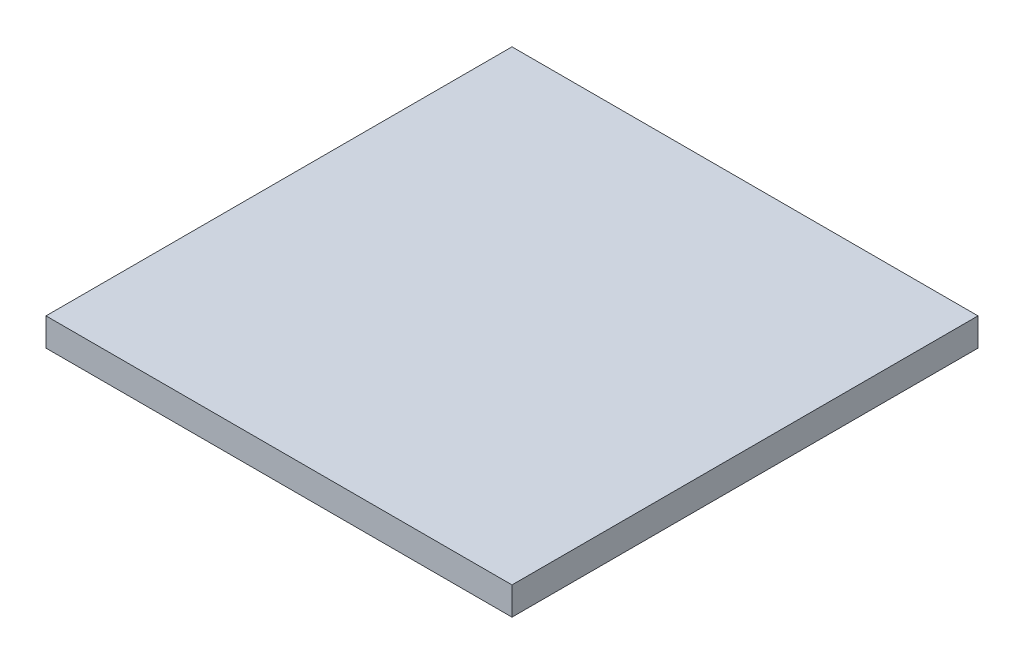
ISO-10303-21;
HEADER;
FILE_DESCRIPTION(('STEP AP214'),'2;1');
FILE_NAME('part.step','',(''),(''),'','','');
FILE_SCHEMA(('AUTOMOTIVE_DESIGN { 1 0 10303 214 1 1 1 1 }'));
ENDSEC;
DATA;
#1=APPLICATION_CONTEXT('core data for automotive mechanical design processes');
#2=APPLICATION_PROTOCOL_DEFINITION('international standard','automotive_design',2000,#1);
#3=PRODUCT_CONTEXT('',#1,'mechanical');
#4=PRODUCT('Part','Part','',(#3));
#5=PRODUCT_RELATED_PRODUCT_CATEGORY('part','',(#4));
#6=PRODUCT_DEFINITION_FORMATION('','',#4);
#7=PRODUCT_DEFINITION_CONTEXT('part definition',#1,'design');
#8=PRODUCT_DEFINITION('design','',#6,#7);
#9=PRODUCT_DEFINITION_SHAPE('','',#8);
#10=(LENGTH_UNIT() NAMED_UNIT(*) SI_UNIT(.MILLI.,.METRE.));
#11=(NAMED_UNIT(*) PLANE_ANGLE_UNIT() SI_UNIT($,.RADIAN.));
#12=(NAMED_UNIT(*) SI_UNIT($,.STERADIAN.) SOLID_ANGLE_UNIT());
#13=UNCERTAINTY_MEASURE_WITH_UNIT(LENGTH_MEASURE(1.E-05),#10,'distance_accuracy_value','');
#14=(GEOMETRIC_REPRESENTATION_CONTEXT(3) GLOBAL_UNCERTAINTY_ASSIGNED_CONTEXT((#13)) GLOBAL_UNIT_ASSIGNED_CONTEXT((#10,
#11,#12)) REPRESENTATION_CONTEXT('',''));
#15=CARTESIAN_POINT('',(0.,0.,0.));
#16=DIRECTION('',(0.,0.,1.));
#17=DIRECTION('',(1.,0.,0.));
#18=AXIS2_PLACEMENT_3D('',#15,#16,#17);
#19=CARTESIAN_POINT('',(-635.,76.2,635.));
#20=DIRECTION('',(1.,0.,0.));
#21=DIRECTION('',(0.,0.,-1.));
#22=AXIS2_PLACEMENT_3D('',#19,#20,#21);
#23=PLANE('',#22);
#24=DIRECTION('',(0.,0.,1.));
#25=VECTOR('',#24,1.);
#26=CARTESIAN_POINT('',(-635.,0.,635.));
#27=LINE('',#26,#25);
#28=CARTESIAN_POINT('',(-635.,0.,-635.));
#29=VERTEX_POINT('',#28);
#30=CARTESIAN_POINT('',(-635.,0.,635.));
#31=VERTEX_POINT('',#30);
#32=EDGE_CURVE('E102',#29,#31,#27,.T.);
#33=ORIENTED_EDGE('',*,*,#32,.T.);
#34=DIRECTION('',(0.,-1.,0.));
#35=VECTOR('',#34,1.);
#36=CARTESIAN_POINT('',(-635.,76.2,635.));
#37=LINE('',#36,#35);
#38=CARTESIAN_POINT('',(-635.,76.2,635.));
#39=VERTEX_POINT('',#38);
#40=EDGE_CURVE('E11',#39,#31,#37,.T.);
#41=ORIENTED_EDGE('',*,*,#40,.F.);
#42=DIRECTION('',(0.,0.,1.));
#43=VECTOR('',#42,1.);
#44=CARTESIAN_POINT('',(-635.,76.2,635.));
#45=LINE('',#44,#43);
#46=CARTESIAN_POINT('',(-635.,76.2,-635.));
#47=VERTEX_POINT('',#46);
#48=EDGE_CURVE('E90',#47,#39,#45,.T.);
#49=ORIENTED_EDGE('',*,*,#48,.F.);
#50=DIRECTION('',(0.,-1.,0.));
#51=VECTOR('',#50,1.);
#52=CARTESIAN_POINT('',(-635.,76.2,-635.));
#53=LINE('',#52,#51);
#54=EDGE_CURVE('E98',#47,#29,#53,.T.);
#55=ORIENTED_EDGE('',*,*,#54,.T.);
#56=EDGE_LOOP('',(#33,#41,#49,#55));
#57=FACE_BOUND('',#56,.T.);
#58=ADVANCED_FACE('F39',(#57),#23,.F.);
#59=CARTESIAN_POINT('',(635.,76.2,635.));
#60=DIRECTION('',(0.,0.,-1.));
#61=DIRECTION('',(-1.,0.,0.));
#62=AXIS2_PLACEMENT_3D('',#59,#60,#61);
#63=PLANE('',#62);
#64=DIRECTION('',(1.,0.,0.));
#65=VECTOR('',#64,1.);
#66=CARTESIAN_POINT('',(635.,0.,635.));
#67=LINE('',#66,#65);
#68=CARTESIAN_POINT('',(635.,0.,635.));
#69=VERTEX_POINT('',#68);
#70=EDGE_CURVE('E94',#31,#69,#67,.T.);
#71=ORIENTED_EDGE('',*,*,#70,.T.);
#72=DIRECTION('',(0.,-1.,0.));
#73=VECTOR('',#72,1.);
#74=CARTESIAN_POINT('',(635.,76.2,635.));
#75=LINE('',#74,#73);
#76=CARTESIAN_POINT('',(635.,76.2,635.));
#77=VERTEX_POINT('',#76);
#78=EDGE_CURVE('E47',#77,#69,#75,.T.);
#79=ORIENTED_EDGE('',*,*,#78,.F.);
#80=DIRECTION('',(1.,0.,0.));
#81=VECTOR('',#80,1.);
#82=CARTESIAN_POINT('',(635.,76.2,635.));
#83=LINE('',#82,#81);
#84=EDGE_CURVE('E85',#39,#77,#83,.T.);
#85=ORIENTED_EDGE('',*,*,#84,.F.);
#86=ORIENTED_EDGE('',*,*,#40,.T.);
#87=EDGE_LOOP('',(#71,#79,#85,#86));
#88=FACE_BOUND('',#87,.T.);
#89=ADVANCED_FACE('F93',(#88),#63,.F.);
#90=CARTESIAN_POINT('',(635.,76.2,635.));
#91=DIRECTION('',(-1.,0.,0.));
#92=DIRECTION('',(0.,0.,1.));
#93=AXIS2_PLACEMENT_3D('',#90,#91,#92);
#94=PLANE('',#93);
#95=DIRECTION('',(0.,0.,-1.));
#96=VECTOR('',#95,1.);
#97=CARTESIAN_POINT('',(635.,0.,635.));
#98=LINE('',#97,#96);
#99=CARTESIAN_POINT('',(635.,0.,-635.));
#100=VERTEX_POINT('',#99);
#101=EDGE_CURVE('E72',#69,#100,#98,.T.);
#102=ORIENTED_EDGE('',*,*,#101,.T.);
#103=DIRECTION('',(0.,-1.,0.));
#104=VECTOR('',#103,1.);
#105=CARTESIAN_POINT('',(635.,76.2,-635.));
#106=LINE('',#105,#104);
#107=CARTESIAN_POINT('',(635.,76.2,-635.));
#108=VERTEX_POINT('',#107);
#109=EDGE_CURVE('E95',#108,#100,#106,.T.);
#110=ORIENTED_EDGE('',*,*,#109,.F.);
#111=DIRECTION('',(0.,0.,-1.));
#112=VECTOR('',#111,1.);
#113=CARTESIAN_POINT('',(635.,76.2,635.));
#114=LINE('',#113,#112);
#115=EDGE_CURVE('E88',#77,#108,#114,.T.);
#116=ORIENTED_EDGE('',*,*,#115,.F.);
#117=ORIENTED_EDGE('',*,*,#78,.T.);
#118=EDGE_LOOP('',(#102,#110,#116,#117));
#119=FACE_BOUND('',#118,.T.);
#120=ADVANCED_FACE('F96',(#119),#94,.F.);
#121=CARTESIAN_POINT('',(635.,76.2,-635.));
#122=DIRECTION('',(0.,0.,1.));
#123=DIRECTION('',(1.,0.,0.));
#124=AXIS2_PLACEMENT_3D('',#121,#122,#123);
#125=PLANE('',#124);
#126=DIRECTION('',(-1.,0.,0.));
#127=VECTOR('',#126,1.);
#128=CARTESIAN_POINT('',(635.,0.,-635.));
#129=LINE('',#128,#127);
#130=EDGE_CURVE('E78',#100,#29,#129,.T.);
#131=ORIENTED_EDGE('',*,*,#130,.T.);
#132=ORIENTED_EDGE('',*,*,#54,.F.);
#133=DIRECTION('',(-1.,0.,0.));
#134=VECTOR('',#133,1.);
#135=CARTESIAN_POINT('',(635.,76.2,-635.));
#136=LINE('',#135,#134);
#137=EDGE_CURVE('E55',#108,#47,#136,.T.);
#138=ORIENTED_EDGE('',*,*,#137,.F.);
#139=ORIENTED_EDGE('',*,*,#109,.T.);
#140=EDGE_LOOP('',(#131,#132,#138,#139));
#141=FACE_BOUND('',#140,.T.);
#142=ADVANCED_FACE('F109',(#141),#125,.F.);
#143=CARTESIAN_POINT('',(0.,76.2,0.));
#144=DIRECTION('',(0.,1.,0.));
#145=DIRECTION('',(0.,0.,1.));
#146=AXIS2_PLACEMENT_3D('',#143,#144,#145);
#147=PLANE('',#146);
#148=ORIENTED_EDGE('',*,*,#48,.T.);
#149=ORIENTED_EDGE('',*,*,#84,.T.);
#150=ORIENTED_EDGE('',*,*,#115,.T.);
#151=ORIENTED_EDGE('',*,*,#137,.T.);
#152=EDGE_LOOP('',(#148,#149,#150,#151));
#153=FACE_BOUND('',#152,.T.);
#154=ADVANCED_FACE('F86',(#153),#147,.T.);
#155=CARTESIAN_POINT('',(0.,0.,0.));
#156=DIRECTION('',(0.,1.,0.));
#157=DIRECTION('',(0.,0.,1.));
#158=AXIS2_PLACEMENT_3D('',#155,#156,#157);
#159=PLANE('',#158);
#160=ORIENTED_EDGE('',*,*,#32,.F.);
#161=ORIENTED_EDGE('',*,*,#130,.F.);
#162=ORIENTED_EDGE('',*,*,#101,.F.);
#163=ORIENTED_EDGE('',*,*,#70,.F.);
#164=EDGE_LOOP('',(#160,#161,#162,#163));
#165=FACE_BOUND('',#164,.T.);
#166=ADVANCED_FACE('F112',(#165),#159,.F.);
#167=CLOSED_SHELL('',(#58,#89,#120,#142,#154,#166));
#168=MANIFOLD_SOLID_BREP('B2',#167);
#169=ADVANCED_BREP_SHAPE_REPRESENTATION('',(#18,#168),#14);
#170=SHAPE_DEFINITION_REPRESENTATION(#9,#169);
ENDSEC;
END-ISO-10303-21;
